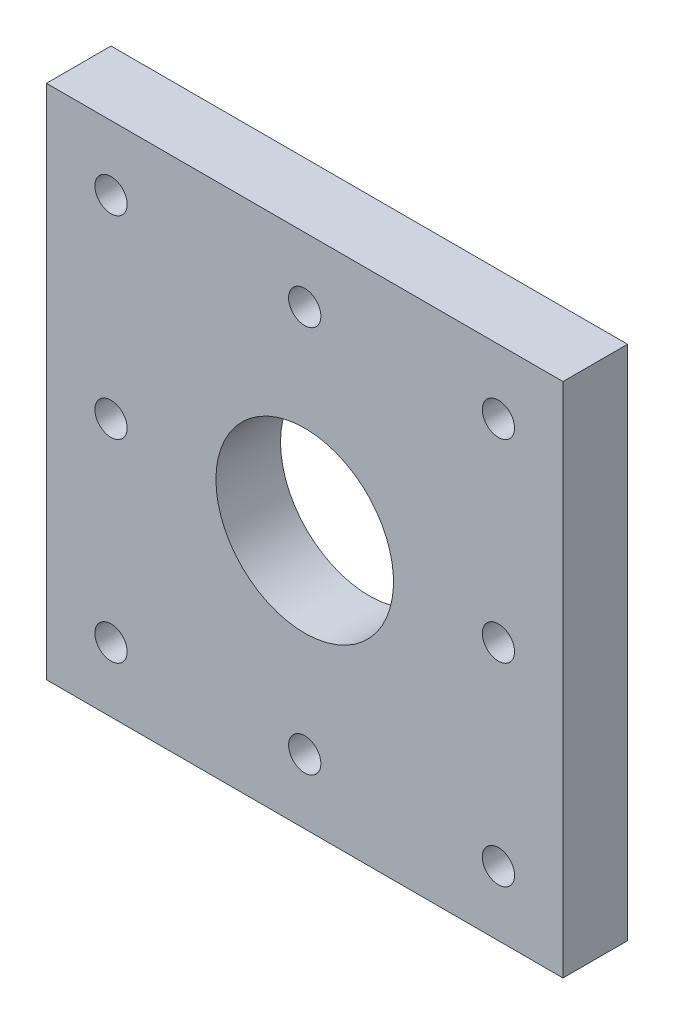
ISO-10303-21;
HEADER;
FILE_DESCRIPTION(('STEP AP214'),'2;1');
FILE_NAME('part.step','',(''),(''),'','','');
FILE_SCHEMA(('AUTOMOTIVE_DESIGN { 1 0 10303 214 1 1 1 1 }'));
ENDSEC;
DATA;
#1=APPLICATION_CONTEXT('core data for automotive mechanical design processes');
#2=APPLICATION_PROTOCOL_DEFINITION('international standard','automotive_design',2000,#1);
#3=PRODUCT_CONTEXT('',#1,'mechanical');
#4=PRODUCT('Part','Part','',(#3));
#5=PRODUCT_RELATED_PRODUCT_CATEGORY('part','',(#4));
#6=PRODUCT_DEFINITION_FORMATION('','',#4);
#7=PRODUCT_DEFINITION_CONTEXT('part definition',#1,'design');
#8=PRODUCT_DEFINITION('design','',#6,#7);
#9=PRODUCT_DEFINITION_SHAPE('','',#8);
#10=(LENGTH_UNIT() NAMED_UNIT(*) SI_UNIT(.MILLI.,.METRE.));
#11=(NAMED_UNIT(*) PLANE_ANGLE_UNIT() SI_UNIT($,.RADIAN.));
#12=(NAMED_UNIT(*) SI_UNIT($,.STERADIAN.) SOLID_ANGLE_UNIT());
#13=UNCERTAINTY_MEASURE_WITH_UNIT(LENGTH_MEASURE(1.E-05),#10,'distance_accuracy_value','');
#14=(GEOMETRIC_REPRESENTATION_CONTEXT(3) GLOBAL_UNCERTAINTY_ASSIGNED_CONTEXT((#13)) GLOBAL_UNIT_ASSIGNED_CONTEXT((#10,
#11,#12)) REPRESENTATION_CONTEXT('',''));
#15=CARTESIAN_POINT('',(0.,0.,0.));
#16=DIRECTION('',(0.,0.,1.));
#17=DIRECTION('',(1.,0.,0.));
#18=AXIS2_PLACEMENT_3D('',#15,#16,#17);
#19=CARTESIAN_POINT('',(0.,0.,6.35));
#20=DIRECTION('',(1.,0.,0.));
#21=DIRECTION('',(0.,1.,0.));
#22=AXIS2_PLACEMENT_3D('',#19,#20,#21);
#23=PLANE('',#22);
#24=DIRECTION('',(0.,-1.,0.));
#25=VECTOR('',#24,1.);
#26=CARTESIAN_POINT('',(0.,0.,0.));
#27=LINE('',#26,#25);
#28=CARTESIAN_POINT('',(0.,50.8,0.));
#29=VERTEX_POINT('',#28);
#30=CARTESIAN_POINT('',(0.,0.,0.));
#31=VERTEX_POINT('',#30);
#32=EDGE_CURVE('E98',#29,#31,#27,.T.);
#33=ORIENTED_EDGE('',*,*,#32,.T.);
#34=DIRECTION('',(0.,0.,-1.));
#35=VECTOR('',#34,1.);
#36=CARTESIAN_POINT('',(0.,0.,6.35));
#37=LINE('',#36,#35);
#38=CARTESIAN_POINT('',(0.,0.,6.35));
#39=VERTEX_POINT('',#38);
#40=EDGE_CURVE('E11',#39,#31,#37,.T.);
#41=ORIENTED_EDGE('',*,*,#40,.F.);
#42=DIRECTION('',(0.,-1.,0.));
#43=VECTOR('',#42,1.);
#44=CARTESIAN_POINT('',(0.,0.,6.35));
#45=LINE('',#44,#43);
#46=CARTESIAN_POINT('',(0.,50.8,6.35));
#47=VERTEX_POINT('',#46);
#48=EDGE_CURVE('E86',#47,#39,#45,.T.);
#49=ORIENTED_EDGE('',*,*,#48,.F.);
#50=DIRECTION('',(0.,0.,-1.));
#51=VECTOR('',#50,1.);
#52=CARTESIAN_POINT('',(0.,50.8,6.35));
#53=LINE('',#52,#51);
#54=EDGE_CURVE('E94',#47,#29,#53,.T.);
#55=ORIENTED_EDGE('',*,*,#54,.T.);
#56=EDGE_LOOP('',(#33,#41,#49,#55));
#57=FACE_BOUND('',#56,.T.);
#58=ADVANCED_FACE('F35',(#57),#23,.F.);
#59=CARTESIAN_POINT('',(0.,0.,6.35));
#60=DIRECTION('',(0.,1.,0.));
#61=DIRECTION('',(0.,0.,1.));
#62=AXIS2_PLACEMENT_3D('',#59,#60,#61);
#63=PLANE('',#62);
#64=DIRECTION('',(1.,0.,0.));
#65=VECTOR('',#64,1.);
#66=CARTESIAN_POINT('',(0.,0.,0.));
#67=LINE('',#66,#65);
#68=CARTESIAN_POINT('',(50.8,0.,0.));
#69=VERTEX_POINT('',#68);
#70=EDGE_CURVE('E90',#31,#69,#67,.T.);
#71=ORIENTED_EDGE('',*,*,#70,.T.);
#72=DIRECTION('',(0.,0.,-1.));
#73=VECTOR('',#72,1.);
#74=CARTESIAN_POINT('',(50.8,0.,6.35));
#75=LINE('',#74,#73);
#76=CARTESIAN_POINT('',(50.8,0.,6.35));
#77=VERTEX_POINT('',#76);
#78=EDGE_CURVE('E43',#77,#69,#75,.T.);
#79=ORIENTED_EDGE('',*,*,#78,.F.);
#80=DIRECTION('',(1.,0.,0.));
#81=VECTOR('',#80,1.);
#82=CARTESIAN_POINT('',(0.,0.,6.35));
#83=LINE('',#82,#81);
#84=EDGE_CURVE('E81',#39,#77,#83,.T.);
#85=ORIENTED_EDGE('',*,*,#84,.F.);
#86=ORIENTED_EDGE('',*,*,#40,.T.);
#87=EDGE_LOOP('',(#71,#79,#85,#86));
#88=FACE_BOUND('',#87,.T.);
#89=ADVANCED_FACE('F89',(#88),#63,.F.);
#90=CARTESIAN_POINT('',(50.8,0.,6.35));
#91=DIRECTION('',(-1.,0.,0.));
#92=DIRECTION('',(0.,-1.,0.));
#93=AXIS2_PLACEMENT_3D('',#90,#91,#92);
#94=PLANE('',#93);
#95=DIRECTION('',(0.,1.,0.));
#96=VECTOR('',#95,1.);
#97=CARTESIAN_POINT('',(50.8,0.,0.));
#98=LINE('',#97,#96);
#99=CARTESIAN_POINT('',(50.8,50.8,0.));
#100=VERTEX_POINT('',#99);
#101=EDGE_CURVE('E68',#69,#100,#98,.T.);
#102=ORIENTED_EDGE('',*,*,#101,.T.);
#103=DIRECTION('',(0.,0.,-1.));
#104=VECTOR('',#103,1.);
#105=CARTESIAN_POINT('',(50.8,50.8,6.35));
#106=LINE('',#105,#104);
#107=CARTESIAN_POINT('',(50.8,50.8,6.35));
#108=VERTEX_POINT('',#107);
#109=EDGE_CURVE('E91',#108,#100,#106,.T.);
#110=ORIENTED_EDGE('',*,*,#109,.F.);
#111=DIRECTION('',(0.,1.,0.));
#112=VECTOR('',#111,1.);
#113=CARTESIAN_POINT('',(50.8,0.,6.35));
#114=LINE('',#113,#112);
#115=EDGE_CURVE('E84',#77,#108,#114,.T.);
#116=ORIENTED_EDGE('',*,*,#115,.F.);
#117=ORIENTED_EDGE('',*,*,#78,.T.);
#118=EDGE_LOOP('',(#102,#110,#116,#117));
#119=FACE_BOUND('',#118,.T.);
#120=ADVANCED_FACE('F92',(#119),#94,.F.);
#121=CARTESIAN_POINT('',(0.,50.8,6.35));
#122=DIRECTION('',(0.,-1.,0.));
#123=DIRECTION('',(0.,0.,-1.));
#124=AXIS2_PLACEMENT_3D('',#121,#122,#123);
#125=PLANE('',#124);
#126=DIRECTION('',(-1.,0.,0.));
#127=VECTOR('',#126,1.);
#128=CARTESIAN_POINT('',(0.,50.8,0.));
#129=LINE('',#128,#127);
#130=EDGE_CURVE('E74',#100,#29,#129,.T.);
#131=ORIENTED_EDGE('',*,*,#130,.T.);
#132=ORIENTED_EDGE('',*,*,#54,.F.);
#133=DIRECTION('',(-1.,0.,0.));
#134=VECTOR('',#133,1.);
#135=CARTESIAN_POINT('',(0.,50.8,6.35));
#136=LINE('',#135,#134);
#137=EDGE_CURVE('E51',#108,#47,#136,.T.);
#138=ORIENTED_EDGE('',*,*,#137,.F.);
#139=ORIENTED_EDGE('',*,*,#109,.T.);
#140=EDGE_LOOP('',(#131,#132,#138,#139));
#141=FACE_BOUND('',#140,.T.);
#142=ADVANCED_FACE('F106',(#141),#125,.F.);
#143=CARTESIAN_POINT('',(0.,50.8,6.35));
#144=DIRECTION('',(0.,0.,-1.));
#145=DIRECTION('',(-1.,0.,0.));
#146=AXIS2_PLACEMENT_3D('',#143,#144,#145);
#147=PLANE('',#146);
#148=CARTESIAN_POINT('',(6.35000000000058,44.45,6.35));
#149=DIRECTION('',(0.,0.,-1.));
#150=DIRECTION('',(-1.,0.,0.));
#151=AXIS2_PLACEMENT_3D('',#148,#149,#150);
#152=CIRCLE('',#151,1.5875);
#153=CARTESIAN_POINT('',(4.76250000000058,44.45,6.35));
#154=VERTEX_POINT('',#153);
#155=EDGE_CURVE('E157',#154,#154,#152,.T.);
#156=ORIENTED_EDGE('',*,*,#155,.T.);
#157=EDGE_LOOP('',(#156));
#158=FACE_BOUND('',#157,.T.);
#159=CARTESIAN_POINT('',(44.4500000000004,44.4500000000002,6.35));
#160=DIRECTION('',(0.,0.,-1.));
#161=DIRECTION('',(-1.,0.,0.));
#162=AXIS2_PLACEMENT_3D('',#159,#160,#161);
#163=CIRCLE('',#162,1.5875);
#164=CARTESIAN_POINT('',(42.8625000000004,44.4500000000002,6.35));
#165=VERTEX_POINT('',#164);
#166=EDGE_CURVE('E151',#165,#165,#163,.T.);
#167=ORIENTED_EDGE('',*,*,#166,.T.);
#168=EDGE_LOOP('',(#167));
#169=FACE_BOUND('',#168,.T.);
#170=CARTESIAN_POINT('',(44.4499999999998,6.35000000000013,6.35));
#171=DIRECTION('',(0.,0.,-1.));
#172=DIRECTION('',(-1.,0.,0.));
#173=AXIS2_PLACEMENT_3D('',#170,#171,#172);
#174=CIRCLE('',#173,1.5875);
#175=CARTESIAN_POINT('',(42.8624999999998,6.35000000000013,6.35));
#176=VERTEX_POINT('',#175);
#177=EDGE_CURVE('E145',#176,#176,#174,.T.);
#178=ORIENTED_EDGE('',*,*,#177,.T.);
#179=EDGE_LOOP('',(#178));
#180=FACE_BOUND('',#179,.T.);
#181=CARTESIAN_POINT('',(6.35000000000038,6.35000000000013,6.35));
#182=DIRECTION('',(0.,0.,-1.));
#183=DIRECTION('',(-1.,0.,0.));
#184=AXIS2_PLACEMENT_3D('',#181,#182,#183);
#185=CIRCLE('',#184,1.5875);
#186=CARTESIAN_POINT('',(4.76250000000038,6.35000000000013,6.35));
#187=VERTEX_POINT('',#186);
#188=EDGE_CURVE('E139',#187,#187,#185,.T.);
#189=ORIENTED_EDGE('',*,*,#188,.T.);
#190=EDGE_LOOP('',(#189));
#191=FACE_BOUND('',#190,.T.);
#192=CARTESIAN_POINT('',(44.45,25.4,6.35));
#193=DIRECTION('',(0.,0.,1.));
#194=DIRECTION('',(1.,0.,0.));
#195=AXIS2_PLACEMENT_3D('',#192,#193,#194);
#196=CIRCLE('',#195,1.5875);
#197=CARTESIAN_POINT('',(46.0375,25.4,6.35));
#198=VERTEX_POINT('',#197);
#199=EDGE_CURVE('E136',#198,#198,#196,.T.);
#200=ORIENTED_EDGE('',*,*,#199,.F.);
#201=EDGE_LOOP('',(#200));
#202=FACE_BOUND('',#201,.T.);
#203=CARTESIAN_POINT('',(25.4,44.45,6.35));
#204=DIRECTION('',(0.,0.,1.));
#205=DIRECTION('',(1.,0.,0.));
#206=AXIS2_PLACEMENT_3D('',#203,#204,#205);
#207=CIRCLE('',#206,1.5875);
#208=CARTESIAN_POINT('',(26.9875,44.45,6.35));
#209=VERTEX_POINT('',#208);
#210=EDGE_CURVE('E130',#209,#209,#207,.T.);
#211=ORIENTED_EDGE('',*,*,#210,.F.);
#212=EDGE_LOOP('',(#211));
#213=FACE_BOUND('',#212,.T.);
#214=CARTESIAN_POINT('',(6.35,25.4,6.35));
#215=DIRECTION('',(0.,0.,1.));
#216=DIRECTION('',(1.,0.,0.));
#217=AXIS2_PLACEMENT_3D('',#214,#215,#216);
#218=CIRCLE('',#217,1.5875);
#219=CARTESIAN_POINT('',(7.9375,25.4,6.35));
#220=VERTEX_POINT('',#219);
#221=EDGE_CURVE('E124',#220,#220,#218,.T.);
#222=ORIENTED_EDGE('',*,*,#221,.F.);
#223=EDGE_LOOP('',(#222));
#224=FACE_BOUND('',#223,.T.);
#225=CARTESIAN_POINT('',(25.4,6.35,6.35));
#226=DIRECTION('',(0.,0.,1.));
#227=DIRECTION('',(1.,0.,0.));
#228=AXIS2_PLACEMENT_3D('',#225,#226,#227);
#229=CIRCLE('',#228,1.5875);
#230=CARTESIAN_POINT('',(26.9875,6.35,6.35));
#231=VERTEX_POINT('',#230);
#232=EDGE_CURVE('E118',#231,#231,#229,.T.);
#233=ORIENTED_EDGE('',*,*,#232,.F.);
#234=EDGE_LOOP('',(#233));
#235=FACE_BOUND('',#234,.T.);
#236=CARTESIAN_POINT('',(25.4,25.4,6.35));
#237=DIRECTION('',(0.,0.,-1.));
#238=DIRECTION('',(-1.,0.,0.));
#239=AXIS2_PLACEMENT_3D('',#236,#237,#238);
#240=CIRCLE('',#239,8.73125);
#241=CARTESIAN_POINT('',(16.66875,25.4,6.35));
#242=VERTEX_POINT('',#241);
#243=EDGE_CURVE('E101',#242,#242,#240,.T.);
#244=ORIENTED_EDGE('',*,*,#243,.T.);
#245=EDGE_LOOP('',(#244));
#246=FACE_BOUND('',#245,.T.);
#247=ORIENTED_EDGE('',*,*,#48,.T.);
#248=ORIENTED_EDGE('',*,*,#84,.T.);
#249=ORIENTED_EDGE('',*,*,#115,.T.);
#250=ORIENTED_EDGE('',*,*,#137,.T.);
#251=EDGE_LOOP('',(#247,#248,#249,#250));
#252=FACE_BOUND('',#251,.T.);
#253=ADVANCED_FACE('F82',(#158,#169,#180,#191,#202,#213,#224,#235,#246,#252),#147,.F.);
#254=CARTESIAN_POINT('',(0.,50.8,0.));
#255=DIRECTION('',(0.,0.,-1.));
#256=DIRECTION('',(-1.,0.,0.));
#257=AXIS2_PLACEMENT_3D('',#254,#255,#256);
#258=PLANE('',#257);
#259=CARTESIAN_POINT('',(6.35000000000058,44.45,0.));
#260=DIRECTION('',(0.,0.,-1.));
#261=DIRECTION('',(-1.,0.,0.));
#262=AXIS2_PLACEMENT_3D('',#259,#260,#261);
#263=CIRCLE('',#262,1.5875);
#264=CARTESIAN_POINT('',(4.76250000000058,44.45,0.));
#265=VERTEX_POINT('',#264);
#266=EDGE_CURVE('E160',#265,#265,#263,.T.);
#267=ORIENTED_EDGE('',*,*,#266,.F.);
#268=EDGE_LOOP('',(#267));
#269=FACE_BOUND('',#268,.T.);
#270=CARTESIAN_POINT('',(44.4500000000004,44.4500000000002,0.));
#271=DIRECTION('',(0.,0.,-1.));
#272=DIRECTION('',(-1.,0.,0.));
#273=AXIS2_PLACEMENT_3D('',#270,#271,#272);
#274=CIRCLE('',#273,1.5875);
#275=CARTESIAN_POINT('',(42.8625000000004,44.4500000000002,0.));
#276=VERTEX_POINT('',#275);
#277=EDGE_CURVE('E154',#276,#276,#274,.T.);
#278=ORIENTED_EDGE('',*,*,#277,.F.);
#279=EDGE_LOOP('',(#278));
#280=FACE_BOUND('',#279,.T.);
#281=CARTESIAN_POINT('',(44.4499999999998,6.35000000000013,0.));
#282=DIRECTION('',(0.,0.,-1.));
#283=DIRECTION('',(-1.,0.,0.));
#284=AXIS2_PLACEMENT_3D('',#281,#282,#283);
#285=CIRCLE('',#284,1.5875);
#286=CARTESIAN_POINT('',(42.8624999999998,6.35000000000013,0.));
#287=VERTEX_POINT('',#286);
#288=EDGE_CURVE('E148',#287,#287,#285,.T.);
#289=ORIENTED_EDGE('',*,*,#288,.F.);
#290=EDGE_LOOP('',(#289));
#291=FACE_BOUND('',#290,.T.);
#292=CARTESIAN_POINT('',(6.35000000000038,6.35000000000013,0.));
#293=DIRECTION('',(0.,0.,-1.));
#294=DIRECTION('',(-1.,0.,0.));
#295=AXIS2_PLACEMENT_3D('',#292,#293,#294);
#296=CIRCLE('',#295,1.5875);
#297=CARTESIAN_POINT('',(4.76250000000038,6.35000000000013,0.));
#298=VERTEX_POINT('',#297);
#299=EDGE_CURVE('E142',#298,#298,#296,.T.);
#300=ORIENTED_EDGE('',*,*,#299,.F.);
#301=EDGE_LOOP('',(#300));
#302=FACE_BOUND('',#301,.T.);
#303=CARTESIAN_POINT('',(44.45,25.4,0.));
#304=DIRECTION('',(0.,0.,1.));
#305=DIRECTION('',(1.,0.,0.));
#306=AXIS2_PLACEMENT_3D('',#303,#304,#305);
#307=CIRCLE('',#306,1.5875);
#308=CARTESIAN_POINT('',(46.0375,25.4,0.));
#309=VERTEX_POINT('',#308);
#310=EDGE_CURVE('E133',#309,#309,#307,.T.);
#311=ORIENTED_EDGE('',*,*,#310,.T.);
#312=EDGE_LOOP('',(#311));
#313=FACE_BOUND('',#312,.T.);
#314=CARTESIAN_POINT('',(25.4,44.45,0.));
#315=DIRECTION('',(0.,0.,1.));
#316=DIRECTION('',(1.,0.,0.));
#317=AXIS2_PLACEMENT_3D('',#314,#315,#316);
#318=CIRCLE('',#317,1.5875);
#319=CARTESIAN_POINT('',(26.9875,44.45,0.));
#320=VERTEX_POINT('',#319);
#321=EDGE_CURVE('E127',#320,#320,#318,.T.);
#322=ORIENTED_EDGE('',*,*,#321,.T.);
#323=EDGE_LOOP('',(#322));
#324=FACE_BOUND('',#323,.T.);
#325=CARTESIAN_POINT('',(6.35,25.4,0.));
#326=DIRECTION('',(0.,0.,1.));
#327=DIRECTION('',(1.,0.,0.));
#328=AXIS2_PLACEMENT_3D('',#325,#326,#327);
#329=CIRCLE('',#328,1.5875);
#330=CARTESIAN_POINT('',(7.9375,25.4,0.));
#331=VERTEX_POINT('',#330);
#332=EDGE_CURVE('E121',#331,#331,#329,.T.);
#333=ORIENTED_EDGE('',*,*,#332,.T.);
#334=EDGE_LOOP('',(#333));
#335=FACE_BOUND('',#334,.T.);
#336=CARTESIAN_POINT('',(25.4,6.35,0.));
#337=DIRECTION('',(0.,0.,1.));
#338=DIRECTION('',(1.,0.,0.));
#339=AXIS2_PLACEMENT_3D('',#336,#337,#338);
#340=CIRCLE('',#339,1.5875);
#341=CARTESIAN_POINT('',(26.9875,6.35,0.));
#342=VERTEX_POINT('',#341);
#343=EDGE_CURVE('E115',#342,#342,#340,.T.);
#344=ORIENTED_EDGE('',*,*,#343,.T.);
#345=EDGE_LOOP('',(#344));
#346=FACE_BOUND('',#345,.T.);
#347=CARTESIAN_POINT('',(25.4,25.4,0.));
#348=DIRECTION('',(0.,0.,-1.));
#349=DIRECTION('',(-1.,0.,0.));
#350=AXIS2_PLACEMENT_3D('',#347,#348,#349);
#351=CIRCLE('',#350,8.73125);
#352=CARTESIAN_POINT('',(16.66875,25.4,0.));
#353=VERTEX_POINT('',#352);
#354=EDGE_CURVE('E112',#353,#353,#351,.T.);
#355=ORIENTED_EDGE('',*,*,#354,.F.);
#356=EDGE_LOOP('',(#355));
#357=FACE_BOUND('',#356,.T.);
#358=ORIENTED_EDGE('',*,*,#32,.F.);
#359=ORIENTED_EDGE('',*,*,#130,.F.);
#360=ORIENTED_EDGE('',*,*,#101,.F.);
#361=ORIENTED_EDGE('',*,*,#70,.F.);
#362=EDGE_LOOP('',(#358,#359,#360,#361));
#363=FACE_BOUND('',#362,.T.);
#364=ADVANCED_FACE('F109',(#269,#280,#291,#302,#313,#324,#335,#346,#357,#363),#258,.T.);
#365=CARTESIAN_POINT('',(25.4,25.4,6.35));
#366=DIRECTION('',(0.,0.,-1.));
#367=DIRECTION('',(-1.,0.,0.));
#368=AXIS2_PLACEMENT_3D('',#365,#366,#367);
#369=CYLINDRICAL_SURFACE('',#368,8.73125);
#370=ORIENTED_EDGE('',*,*,#243,.F.);
#371=EDGE_LOOP('',(#370));
#372=FACE_BOUND('',#371,.T.);
#373=ORIENTED_EDGE('',*,*,#354,.T.);
#374=EDGE_LOOP('',(#373));
#375=FACE_BOUND('',#374,.T.);
#376=ADVANCED_FACE('F177',(#372,#375),#369,.F.);
#377=CARTESIAN_POINT('',(25.4,6.35,0.));
#378=DIRECTION('',(0.,0.,1.));
#379=DIRECTION('',(1.,0.,0.));
#380=AXIS2_PLACEMENT_3D('',#377,#378,#379);
#381=CYLINDRICAL_SURFACE('',#380,1.5875);
#382=ORIENTED_EDGE('',*,*,#343,.F.);
#383=EDGE_LOOP('',(#382));
#384=FACE_BOUND('',#383,.T.);
#385=ORIENTED_EDGE('',*,*,#232,.T.);
#386=EDGE_LOOP('',(#385));
#387=FACE_BOUND('',#386,.T.);
#388=ADVANCED_FACE('F196',(#384,#387),#381,.F.);
#389=CARTESIAN_POINT('',(6.35,25.4,0.));
#390=DIRECTION('',(0.,0.,1.));
#391=DIRECTION('',(1.,0.,0.));
#392=AXIS2_PLACEMENT_3D('',#389,#390,#391);
#393=CYLINDRICAL_SURFACE('',#392,1.5875);
#394=ORIENTED_EDGE('',*,*,#332,.F.);
#395=EDGE_LOOP('',(#394));
#396=FACE_BOUND('',#395,.T.);
#397=ORIENTED_EDGE('',*,*,#221,.T.);
#398=EDGE_LOOP('',(#397));
#399=FACE_BOUND('',#398,.T.);
#400=ADVANCED_FACE('F203',(#396,#399),#393,.F.);
#401=CARTESIAN_POINT('',(25.4,44.45,0.));
#402=DIRECTION('',(0.,0.,1.));
#403=DIRECTION('',(1.,0.,0.));
#404=AXIS2_PLACEMENT_3D('',#401,#402,#403);
#405=CYLINDRICAL_SURFACE('',#404,1.5875);
#406=ORIENTED_EDGE('',*,*,#321,.F.);
#407=EDGE_LOOP('',(#406));
#408=FACE_BOUND('',#407,.T.);
#409=ORIENTED_EDGE('',*,*,#210,.T.);
#410=EDGE_LOOP('',(#409));
#411=FACE_BOUND('',#410,.T.);
#412=ADVANCED_FACE('F273',(#408,#411),#405,.F.);
#413=CARTESIAN_POINT('',(44.45,25.4,0.));
#414=DIRECTION('',(0.,0.,1.));
#415=DIRECTION('',(1.,0.,0.));
#416=AXIS2_PLACEMENT_3D('',#413,#414,#415);
#417=CYLINDRICAL_SURFACE('',#416,1.5875);
#418=ORIENTED_EDGE('',*,*,#310,.F.);
#419=EDGE_LOOP('',(#418));
#420=FACE_BOUND('',#419,.T.);
#421=ORIENTED_EDGE('',*,*,#199,.T.);
#422=EDGE_LOOP('',(#421));
#423=FACE_BOUND('',#422,.T.);
#424=ADVANCED_FACE('F225',(#420,#423),#417,.F.);
#425=CARTESIAN_POINT('',(6.35000000000038,6.35000000000013,6.35));
#426=DIRECTION('',(0.,0.,-1.));
#427=DIRECTION('',(-1.,0.,0.));
#428=AXIS2_PLACEMENT_3D('',#425,#426,#427);
#429=CYLINDRICAL_SURFACE('',#428,1.5875);
#430=ORIENTED_EDGE('',*,*,#188,.F.);
#431=EDGE_LOOP('',(#430));
#432=FACE_BOUND('',#431,.T.);
#433=ORIENTED_EDGE('',*,*,#299,.T.);
#434=EDGE_LOOP('',(#433));
#435=FACE_BOUND('',#434,.T.);
#436=ADVANCED_FACE('F235',(#432,#435),#429,.F.);
#437=CARTESIAN_POINT('',(44.4499999999998,6.35000000000013,6.35));
#438=DIRECTION('',(0.,0.,-1.));
#439=DIRECTION('',(-1.,0.,0.));
#440=AXIS2_PLACEMENT_3D('',#437,#438,#439);
#441=CYLINDRICAL_SURFACE('',#440,1.5875);
#442=ORIENTED_EDGE('',*,*,#177,.F.);
#443=EDGE_LOOP('',(#442));
#444=FACE_BOUND('',#443,.T.);
#445=ORIENTED_EDGE('',*,*,#288,.T.);
#446=EDGE_LOOP('',(#445));
#447=FACE_BOUND('',#446,.T.);
#448=ADVANCED_FACE('F240',(#444,#447),#441,.F.);
#449=CARTESIAN_POINT('',(44.4500000000004,44.4500000000002,6.35));
#450=DIRECTION('',(0.,0.,-1.));
#451=DIRECTION('',(-1.,0.,0.));
#452=AXIS2_PLACEMENT_3D('',#449,#450,#451);
#453=CYLINDRICAL_SURFACE('',#452,1.5875);
#454=ORIENTED_EDGE('',*,*,#166,.F.);
#455=EDGE_LOOP('',(#454));
#456=FACE_BOUND('',#455,.T.);
#457=ORIENTED_EDGE('',*,*,#277,.T.);
#458=EDGE_LOOP('',(#457));
#459=FACE_BOUND('',#458,.T.);
#460=ADVANCED_FACE('F171',(#456,#459),#453,.F.);
#461=CARTESIAN_POINT('',(6.35000000000058,44.45,6.35));
#462=DIRECTION('',(0.,0.,-1.));
#463=DIRECTION('',(-1.,0.,0.));
#464=AXIS2_PLACEMENT_3D('',#461,#462,#463);
#465=CYLINDRICAL_SURFACE('',#464,1.5875);
#466=ORIENTED_EDGE('',*,*,#155,.F.);
#467=EDGE_LOOP('',(#466));
#468=FACE_BOUND('',#467,.T.);
#469=ORIENTED_EDGE('',*,*,#266,.T.);
#470=EDGE_LOOP('',(#469));
#471=FACE_BOUND('',#470,.T.);
#472=ADVANCED_FACE('F168',(#468,#471),#465,.F.);
#473=CLOSED_SHELL('',(#58,#89,#120,#142,#253,#364,#376,#388,#400,#412,#424,#436,#448,#460,#472));
#474=MANIFOLD_SOLID_BREP('B2',#473);
#475=ADVANCED_BREP_SHAPE_REPRESENTATION('',(#18,#474),#14);
#476=SHAPE_DEFINITION_REPRESENTATION(#9,#475);
ENDSEC;
END-ISO-10303-21;
